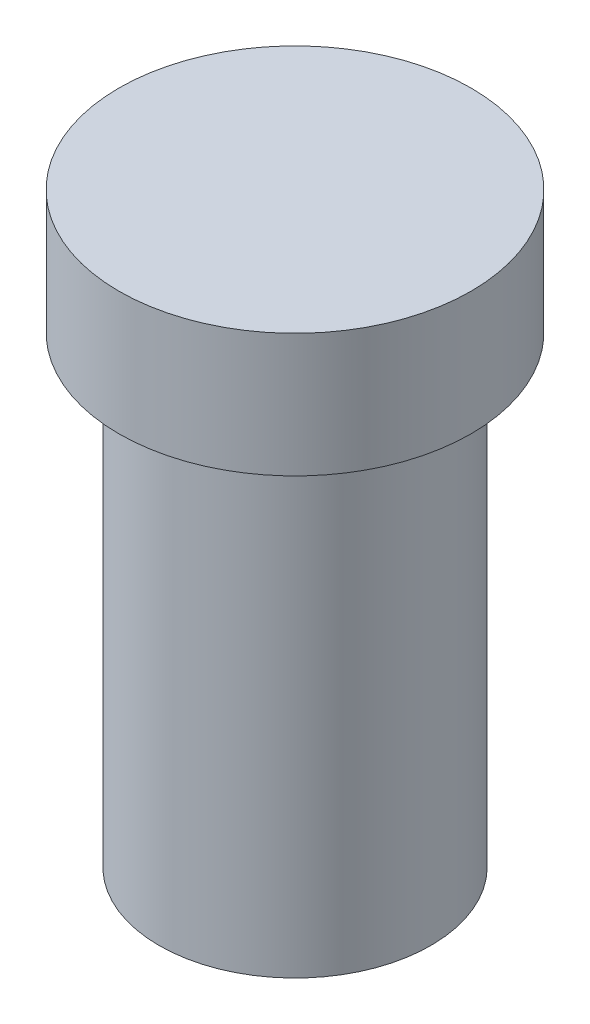
ISO-10303-21;
HEADER;
FILE_DESCRIPTION(('STEP AP214'),'2;1');
FILE_NAME('part.step','',(''),(''),'','','');
FILE_SCHEMA(('AUTOMOTIVE_DESIGN { 1 0 10303 214 1 1 1 1 }'));
ENDSEC;
DATA;
#1=APPLICATION_CONTEXT('core data for automotive mechanical design processes');
#2=APPLICATION_PROTOCOL_DEFINITION('international standard','automotive_design',2000,#1);
#3=PRODUCT_CONTEXT('',#1,'mechanical');
#4=PRODUCT('Part','Part','',(#3));
#5=PRODUCT_RELATED_PRODUCT_CATEGORY('part','',(#4));
#6=PRODUCT_DEFINITION_FORMATION('','',#4);
#7=PRODUCT_DEFINITION_CONTEXT('part definition',#1,'design');
#8=PRODUCT_DEFINITION('design','',#6,#7);
#9=PRODUCT_DEFINITION_SHAPE('','',#8);
#10=(LENGTH_UNIT() NAMED_UNIT(*) SI_UNIT(.MILLI.,.METRE.));
#11=(NAMED_UNIT(*) PLANE_ANGLE_UNIT() SI_UNIT($,.RADIAN.));
#12=(NAMED_UNIT(*) SI_UNIT($,.STERADIAN.) SOLID_ANGLE_UNIT());
#13=UNCERTAINTY_MEASURE_WITH_UNIT(LENGTH_MEASURE(1.E-05),#10,'distance_accuracy_value','');
#14=(GEOMETRIC_REPRESENTATION_CONTEXT(3) GLOBAL_UNCERTAINTY_ASSIGNED_CONTEXT((#13)) GLOBAL_UNIT_ASSIGNED_CONTEXT((#10,
#11,#12)) REPRESENTATION_CONTEXT('',''));
#15=CARTESIAN_POINT('',(0.,0.,0.));
#16=DIRECTION('',(0.,0.,1.));
#17=DIRECTION('',(1.,0.,0.));
#18=AXIS2_PLACEMENT_3D('',#15,#16,#17);
#19=CARTESIAN_POINT('',(0.,37.5,0.));
#20=DIRECTION('',(0.,-1.,0.));
#21=DIRECTION('',(0.,0.,-1.));
#22=AXIS2_PLACEMENT_3D('',#19,#20,#21);
#23=CYLINDRICAL_SURFACE('',#22,22.);
#24=CARTESIAN_POINT('',(0.,37.5,0.));
#25=DIRECTION('',(0.,1.,0.));
#26=DIRECTION('',(0.,0.,1.));
#27=AXIS2_PLACEMENT_3D('',#24,#25,#26);
#28=CIRCLE('',#27,22.);
#29=CARTESIAN_POINT('',(0.,37.5,22.));
#30=VERTEX_POINT('',#29);
#31=EDGE_CURVE('E10',#30,#30,#28,.T.);
#32=ORIENTED_EDGE('',*,*,#31,.F.);
#33=EDGE_LOOP('',(#32));
#34=FACE_BOUND('',#33,.T.);
#35=CARTESIAN_POINT('',(0.,-37.5,0.));
#36=DIRECTION('',(0.,1.,0.));
#37=DIRECTION('',(0.,0.,1.));
#38=AXIS2_PLACEMENT_3D('',#35,#36,#37);
#39=CIRCLE('',#38,22.);
#40=CARTESIAN_POINT('',(0.,-37.5,22.));
#41=VERTEX_POINT('',#40);
#42=EDGE_CURVE('E34',#41,#41,#39,.T.);
#43=ORIENTED_EDGE('',*,*,#42,.T.);
#44=EDGE_LOOP('',(#43));
#45=FACE_BOUND('',#44,.T.);
#46=ADVANCED_FACE('F31',(#34,#45),#23,.T.);
#47=CARTESIAN_POINT('',(0.,-37.5,0.));
#48=DIRECTION('',(0.,1.,0.));
#49=DIRECTION('',(0.,0.,1.));
#50=AXIS2_PLACEMENT_3D('',#47,#48,#49);
#51=PLANE('',#50);
#52=ORIENTED_EDGE('',*,*,#42,.F.);
#53=EDGE_LOOP('',(#52));
#54=FACE_BOUND('',#53,.T.);
#55=ADVANCED_FACE('F54',(#54),#51,.F.);
#56=CARTESIAN_POINT('',(0.,57.5,0.));
#57=DIRECTION('',(0.,-1.,0.));
#58=DIRECTION('',(0.,0.,-1.));
#59=AXIS2_PLACEMENT_3D('',#56,#57,#58);
#60=CYLINDRICAL_SURFACE('',#59,28.5);
#61=CARTESIAN_POINT('',(0.,57.5,0.));
#62=DIRECTION('',(0.,1.,0.));
#63=DIRECTION('',(0.,0.,1.));
#64=AXIS2_PLACEMENT_3D('',#61,#62,#63);
#65=CIRCLE('',#64,28.5);
#66=CARTESIAN_POINT('',(0.,57.5,28.5));
#67=VERTEX_POINT('',#66);
#68=EDGE_CURVE('E41',#67,#67,#65,.T.);
#69=ORIENTED_EDGE('',*,*,#68,.F.);
#70=EDGE_LOOP('',(#69));
#71=FACE_BOUND('',#70,.T.);
#72=CARTESIAN_POINT('',(0.,37.5,0.));
#73=DIRECTION('',(0.,1.,0.));
#74=DIRECTION('',(0.,0.,1.));
#75=AXIS2_PLACEMENT_3D('',#72,#73,#74);
#76=CIRCLE('',#75,28.5);
#77=CARTESIAN_POINT('',(0.,37.5,28.5));
#78=VERTEX_POINT('',#77);
#79=EDGE_CURVE('E43',#78,#78,#76,.T.);
#80=ORIENTED_EDGE('',*,*,#79,.T.);
#81=EDGE_LOOP('',(#80));
#82=FACE_BOUND('',#81,.T.);
#83=ADVANCED_FACE('F51',(#71,#82),#60,.T.);
#84=CARTESIAN_POINT('',(0.,57.5,0.));
#85=DIRECTION('',(0.,1.,0.));
#86=DIRECTION('',(0.,0.,1.));
#87=AXIS2_PLACEMENT_3D('',#84,#85,#86);
#88=PLANE('',#87);
#89=ORIENTED_EDGE('',*,*,#68,.T.);
#90=EDGE_LOOP('',(#89));
#91=FACE_BOUND('',#90,.T.);
#92=ADVANCED_FACE('F49',(#91),#88,.T.);
#93=CARTESIAN_POINT('',(0.,37.5,0.));
#94=DIRECTION('',(0.,1.,0.));
#95=DIRECTION('',(0.,0.,1.));
#96=AXIS2_PLACEMENT_3D('',#93,#94,#95);
#97=PLANE('',#96);
#98=ORIENTED_EDGE('',*,*,#31,.T.);
#99=EDGE_LOOP('',(#98));
#100=FACE_BOUND('',#99,.T.);
#101=ORIENTED_EDGE('',*,*,#79,.F.);
#102=EDGE_LOOP('',(#101));
#103=FACE_BOUND('',#102,.T.);
#104=ADVANCED_FACE('F58',(#100,#103),#97,.F.);
#105=CLOSED_SHELL('',(#46,#55,#83,#92,#104));
#106=MANIFOLD_SOLID_BREP('B2',#105);
#107=ADVANCED_BREP_SHAPE_REPRESENTATION('',(#18,#106),#14);
#108=SHAPE_DEFINITION_REPRESENTATION(#9,#107);
ENDSEC;
END-ISO-10303-21;
